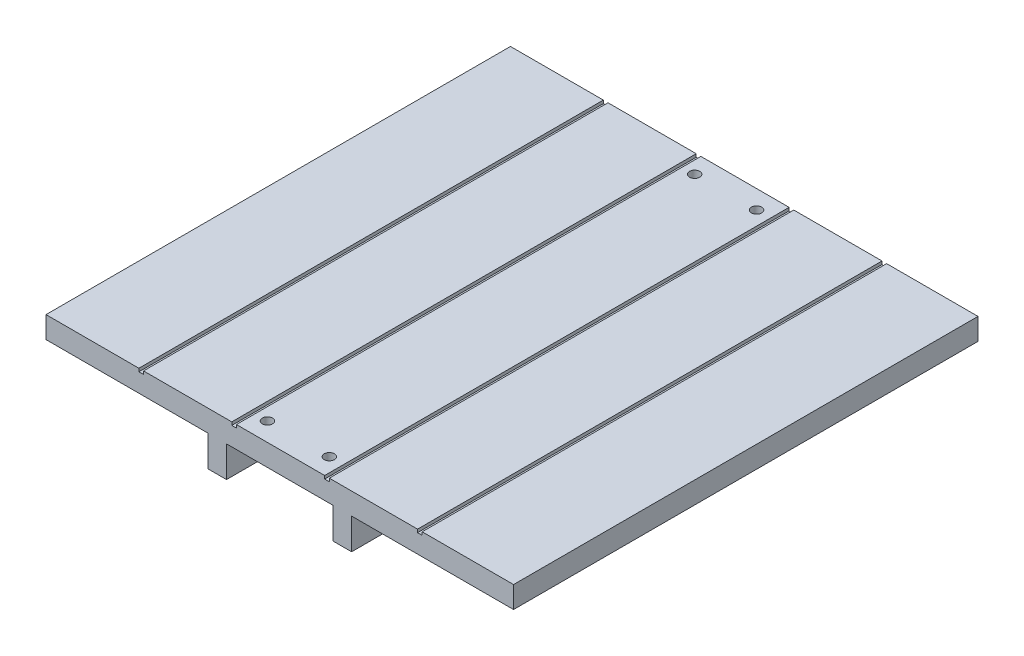
ISO-10303-21;
HEADER;
FILE_DESCRIPTION(('STEP AP214'),'2;1');
FILE_NAME('part.step','',(''),(''),'','','');
FILE_SCHEMA(('AUTOMOTIVE_DESIGN { 1 0 10303 214 1 1 1 1 }'));
ENDSEC;
DATA;
#1=APPLICATION_CONTEXT('core data for automotive mechanical design processes');
#2=APPLICATION_PROTOCOL_DEFINITION('international standard','automotive_design',2000,#1);
#3=PRODUCT_CONTEXT('',#1,'mechanical');
#4=PRODUCT('Part','Part','',(#3));
#5=PRODUCT_RELATED_PRODUCT_CATEGORY('part','',(#4));
#6=PRODUCT_DEFINITION_FORMATION('','',#4);
#7=PRODUCT_DEFINITION_CONTEXT('part definition',#1,'design');
#8=PRODUCT_DEFINITION('design','',#6,#7);
#9=PRODUCT_DEFINITION_SHAPE('','',#8);
#10=(LENGTH_UNIT() NAMED_UNIT(*) SI_UNIT(.MILLI.,.METRE.));
#11=(NAMED_UNIT(*) PLANE_ANGLE_UNIT() SI_UNIT($,.RADIAN.));
#12=(NAMED_UNIT(*) SI_UNIT($,.STERADIAN.) SOLID_ANGLE_UNIT());
#13=UNCERTAINTY_MEASURE_WITH_UNIT(LENGTH_MEASURE(1.E-05),#10,'distance_accuracy_value','');
#14=(GEOMETRIC_REPRESENTATION_CONTEXT(3) GLOBAL_UNCERTAINTY_ASSIGNED_CONTEXT((#13)) GLOBAL_UNIT_ASSIGNED_CONTEXT((#10,
#11,#12)) REPRESENTATION_CONTEXT('',''));
#15=CARTESIAN_POINT('',(0.,0.,0.));
#16=DIRECTION('',(0.,0.,1.));
#17=DIRECTION('',(1.,0.,0.));
#18=AXIS2_PLACEMENT_3D('',#15,#16,#17);
#19=CARTESIAN_POINT('',(-75.5,3.5,150.));
#20=DIRECTION('',(0.,-1.,0.));
#21=DIRECTION('',(0.,0.,-1.));
#22=AXIS2_PLACEMENT_3D('',#19,#20,#21);
#23=PLANE('',#22);
#24=DIRECTION('',(-1.,0.,0.));
#25=VECTOR('',#24,1.);
#26=CARTESIAN_POINT('',(-75.5,3.5,150.));
#27=LINE('',#26,#25);
#28=CARTESIAN_POINT('',(-45.5,3.5,150.));
#29=VERTEX_POINT('',#28);
#30=CARTESIAN_POINT('',(-75.5,3.5,150.));
#31=VERTEX_POINT('',#30);
#32=EDGE_CURVE('E356',#29,#31,#27,.T.);
#33=ORIENTED_EDGE('',*,*,#32,.F.);
#34=DIRECTION('',(0.,0.,1.));
#35=VECTOR('',#34,1.);
#36=CARTESIAN_POINT('',(-45.5,3.5,0.));
#37=LINE('',#36,#35);
#38=CARTESIAN_POINT('',(-45.5,3.5,0.));
#39=VERTEX_POINT('',#38);
#40=EDGE_CURVE('E227',#39,#29,#37,.T.);
#41=ORIENTED_EDGE('',*,*,#40,.F.);
#42=DIRECTION('',(-1.,0.,0.));
#43=VECTOR('',#42,1.);
#44=CARTESIAN_POINT('',(-75.5,3.5,0.));
#45=LINE('',#44,#43);
#46=CARTESIAN_POINT('',(-75.5,3.5,0.));
#47=VERTEX_POINT('',#46);
#48=EDGE_CURVE('E384',#39,#47,#45,.T.);
#49=ORIENTED_EDGE('',*,*,#48,.T.);
#50=DIRECTION('',(0.,0.,-1.));
#51=VECTOR('',#50,1.);
#52=CARTESIAN_POINT('',(-75.5,3.5,150.));
#53=LINE('',#52,#51);
#54=EDGE_CURVE('E432',#31,#47,#53,.T.);
#55=ORIENTED_EDGE('',*,*,#54,.F.);
#56=EDGE_LOOP('',(#33,#41,#49,#55));
#57=FACE_BOUND('',#56,.T.);
#58=ADVANCED_FACE('F36',(#57),#23,.F.);
#59=CARTESIAN_POINT('',(-9.99999999999998,3.5,6.));
#60=DIRECTION('',(0.,-1.,0.));
#61=DIRECTION('',(0.,0.,-1.));
#62=AXIS2_PLACEMENT_3D('',#59,#60,#61);
#63=CIRCLE('',#62,1.65);
#64=CARTESIAN_POINT('',(-9.99999999999998,3.5,4.35));
#65=VERTEX_POINT('',#64);
#66=EDGE_CURVE('E346',#65,#65,#63,.F.);
#67=ORIENTED_EDGE('',*,*,#66,.F.);
#68=EDGE_LOOP('',(#67));
#69=FACE_BOUND('',#68,.T.);
#70=CARTESIAN_POINT('',(10.,3.5,144.));
#71=DIRECTION('',(0.,-1.,0.));
#72=DIRECTION('',(0.,0.,-1.));
#73=AXIS2_PLACEMENT_3D('',#70,#71,#72);
#74=CIRCLE('',#73,1.65);
#75=CARTESIAN_POINT('',(10.,3.5,142.35));
#76=VERTEX_POINT('',#75);
#77=EDGE_CURVE('E328',#76,#76,#74,.F.);
#78=ORIENTED_EDGE('',*,*,#77,.F.);
#79=EDGE_LOOP('',(#78));
#80=FACE_BOUND('',#79,.T.);
#81=CARTESIAN_POINT('',(-10.,3.5,144.));
#82=DIRECTION('',(0.,-1.,0.));
#83=DIRECTION('',(0.,0.,-1.));
#84=AXIS2_PLACEMENT_3D('',#81,#82,#83);
#85=CIRCLE('',#84,1.65);
#86=CARTESIAN_POINT('',(-10.,3.5,142.35));
#87=VERTEX_POINT('',#86);
#88=EDGE_CURVE('E336',#87,#87,#85,.F.);
#89=ORIENTED_EDGE('',*,*,#88,.F.);
#90=EDGE_LOOP('',(#89));
#91=FACE_BOUND('',#90,.T.);
#92=CARTESIAN_POINT('',(9.99999999999998,3.5,6.));
#93=DIRECTION('',(0.,-1.,0.));
#94=DIRECTION('',(0.,0.,-1.));
#95=AXIS2_PLACEMENT_3D('',#92,#93,#94);
#96=CIRCLE('',#95,1.65);
#97=CARTESIAN_POINT('',(9.99999999999998,3.5,4.35));
#98=VERTEX_POINT('',#97);
#99=EDGE_CURVE('E335',#98,#98,#96,.F.);
#100=ORIENTED_EDGE('',*,*,#99,.F.);
#101=EDGE_LOOP('',(#100));
#102=FACE_BOUND('',#101,.T.);
#103=CARTESIAN_POINT('',(14.5,3.5,0.));
#104=VERTEX_POINT('',#103);
#105=CARTESIAN_POINT('',(-14.,3.5,0.));
#106=VERTEX_POINT('',#105);
#107=EDGE_CURVE('E507',#104,#106,#45,.T.);
#108=ORIENTED_EDGE('',*,*,#107,.T.);
#109=DIRECTION('',(0.,0.,-1.));
#110=VECTOR('',#109,1.);
#111=CARTESIAN_POINT('',(-14.,3.5,0.));
#112=LINE('',#111,#110);
#113=CARTESIAN_POINT('',(-14.,3.5,150.));
#114=VERTEX_POINT('',#113);
#115=EDGE_CURVE('E260',#114,#106,#112,.T.);
#116=ORIENTED_EDGE('',*,*,#115,.F.);
#117=CARTESIAN_POINT('',(14.5,3.5,150.));
#118=VERTEX_POINT('',#117);
#119=EDGE_CURVE('E533',#118,#114,#27,.T.);
#120=ORIENTED_EDGE('',*,*,#119,.F.);
#121=DIRECTION('',(0.,0.,1.));
#122=VECTOR('',#121,1.);
#123=CARTESIAN_POINT('',(14.5,3.5,0.));
#124=LINE('',#123,#122);
#125=EDGE_CURVE('E291',#104,#118,#124,.T.);
#126=ORIENTED_EDGE('',*,*,#125,.F.);
#127=EDGE_LOOP('',(#108,#116,#120,#126));
#128=FACE_BOUND('',#127,.T.);
#129=ADVANCED_FACE('F540',(#69,#80,#91,#102,#128),#23,.F.);
#130=CARTESIAN_POINT('',(44.5,3.5,0.));
#131=VERTEX_POINT('',#130);
#132=CARTESIAN_POINT('',(16.,3.5,0.));
#133=VERTEX_POINT('',#132);
#134=EDGE_CURVE('E389',#131,#133,#45,.T.);
#135=ORIENTED_EDGE('',*,*,#134,.T.);
#136=DIRECTION('',(0.,0.,-1.));
#137=VECTOR('',#136,1.);
#138=CARTESIAN_POINT('',(16.,3.5,0.));
#139=LINE('',#138,#137);
#140=CARTESIAN_POINT('',(16.,3.5,150.));
#141=VERTEX_POINT('',#140);
#142=EDGE_CURVE('E283',#141,#133,#139,.T.);
#143=ORIENTED_EDGE('',*,*,#142,.F.);
#144=CARTESIAN_POINT('',(44.5,3.5,150.));
#145=VERTEX_POINT('',#144);
#146=EDGE_CURVE('E361',#145,#141,#27,.T.);
#147=ORIENTED_EDGE('',*,*,#146,.F.);
#148=DIRECTION('',(0.,0.,1.));
#149=VECTOR('',#148,1.);
#150=CARTESIAN_POINT('',(44.5,3.5,0.));
#151=LINE('',#150,#149);
#152=EDGE_CURVE('E315',#131,#145,#151,.T.);
#153=ORIENTED_EDGE('',*,*,#152,.F.);
#154=EDGE_LOOP('',(#135,#143,#147,#153));
#155=FACE_BOUND('',#154,.T.);
#156=ADVANCED_FACE('F522',(#155),#23,.F.);
#157=CARTESIAN_POINT('',(75.5,3.5,0.));
#158=VERTEX_POINT('',#157);
#159=CARTESIAN_POINT('',(46.,3.5,0.));
#160=VERTEX_POINT('',#159);
#161=EDGE_CURVE('E385',#158,#160,#45,.T.);
#162=ORIENTED_EDGE('',*,*,#161,.T.);
#163=DIRECTION('',(0.,0.,-1.));
#164=VECTOR('',#163,1.);
#165=CARTESIAN_POINT('',(46.,3.5,0.));
#166=LINE('',#165,#164);
#167=CARTESIAN_POINT('',(46.,3.5,150.));
#168=VERTEX_POINT('',#167);
#169=EDGE_CURVE('E307',#168,#160,#166,.T.);
#170=ORIENTED_EDGE('',*,*,#169,.F.);
#171=CARTESIAN_POINT('',(75.5,3.5,150.));
#172=VERTEX_POINT('',#171);
#173=EDGE_CURVE('E357',#172,#168,#27,.T.);
#174=ORIENTED_EDGE('',*,*,#173,.F.);
#175=DIRECTION('',(0.,0.,-1.));
#176=VECTOR('',#175,1.);
#177=CARTESIAN_POINT('',(75.5,3.5,150.));
#178=LINE('',#177,#176);
#179=EDGE_CURVE('E44',#172,#158,#178,.T.);
#180=ORIENTED_EDGE('',*,*,#179,.T.);
#181=EDGE_LOOP('',(#162,#170,#174,#180));
#182=FACE_BOUND('',#181,.T.);
#183=ADVANCED_FACE('F439',(#182),#23,.F.);
#184=CARTESIAN_POINT('',(23.2,-3.49999999999996,150.));
#185=DIRECTION('',(0.,1.,0.));
#186=DIRECTION('',(-1.,0.,0.));
#187=AXIS2_PLACEMENT_3D('',#184,#185,#186);
#188=PLANE('',#187);
#189=DIRECTION('',(1.,0.,0.));
#190=VECTOR('',#189,1.);
#191=CARTESIAN_POINT('',(23.2,-3.49999999999996,0.));
#192=LINE('',#191,#190);
#193=CARTESIAN_POINT('',(23.2,-3.49999999999996,0.));
#194=VERTEX_POINT('',#193);
#195=CARTESIAN_POINT('',(75.5,-3.5,0.));
#196=VERTEX_POINT('',#195);
#197=EDGE_CURVE('E349',#194,#196,#192,.T.);
#198=ORIENTED_EDGE('',*,*,#197,.T.);
#199=DIRECTION('',(0.,0.,-1.));
#200=VECTOR('',#199,1.);
#201=CARTESIAN_POINT('',(75.5,-3.5,150.));
#202=LINE('',#201,#200);
#203=CARTESIAN_POINT('',(75.5,-3.5,150.));
#204=VERTEX_POINT('',#203);
#205=EDGE_CURVE('E11',#204,#196,#202,.T.);
#206=ORIENTED_EDGE('',*,*,#205,.F.);
#207=DIRECTION('',(1.,0.,0.));
#208=VECTOR('',#207,1.);
#209=CARTESIAN_POINT('',(23.2,-3.49999999999996,150.));
#210=LINE('',#209,#208);
#211=CARTESIAN_POINT('',(23.2,-3.49999999999996,150.));
#212=VERTEX_POINT('',#211);
#213=EDGE_CURVE('E350',#212,#204,#210,.T.);
#214=ORIENTED_EDGE('',*,*,#213,.F.);
#215=DIRECTION('',(0.,0.,-1.));
#216=VECTOR('',#215,1.);
#217=CARTESIAN_POINT('',(23.2,-3.49999999999996,150.));
#218=LINE('',#217,#216);
#219=EDGE_CURVE('E379',#212,#194,#218,.T.);
#220=ORIENTED_EDGE('',*,*,#219,.T.);
#221=EDGE_LOOP('',(#198,#206,#214,#220));
#222=FACE_BOUND('',#221,.T.);
#223=ADVANCED_FACE('F38',(#222),#188,.F.);
#224=CARTESIAN_POINT('',(75.5,3.5,150.));
#225=DIRECTION('',(-1.,0.,0.));
#226=DIRECTION('',(0.,0.,1.));
#227=AXIS2_PLACEMENT_3D('',#224,#225,#226);
#228=PLANE('',#227);
#229=DIRECTION('',(0.,1.,0.));
#230=VECTOR('',#229,1.);
#231=CARTESIAN_POINT('',(75.5,3.5,0.));
#232=LINE('',#231,#230);
#233=EDGE_CURVE('E382',#196,#158,#232,.T.);
#234=ORIENTED_EDGE('',*,*,#233,.T.);
#235=ORIENTED_EDGE('',*,*,#179,.F.);
#236=DIRECTION('',(0.,1.,0.));
#237=VECTOR('',#236,1.);
#238=CARTESIAN_POINT('',(75.5,3.5,150.));
#239=LINE('',#238,#237);
#240=EDGE_CURVE('E353',#204,#172,#239,.T.);
#241=ORIENTED_EDGE('',*,*,#240,.F.);
#242=ORIENTED_EDGE('',*,*,#205,.T.);
#243=EDGE_LOOP('',(#234,#235,#241,#242));
#244=FACE_BOUND('',#243,.T.);
#245=ADVANCED_FACE('F455',(#244),#228,.F.);
#246=CARTESIAN_POINT('',(-15.5,3.5,0.));
#247=VERTEX_POINT('',#246);
#248=CARTESIAN_POINT('',(-44.,3.5,0.));
#249=VERTEX_POINT('',#248);
#250=EDGE_CURVE('E505',#247,#249,#45,.T.);
#251=ORIENTED_EDGE('',*,*,#250,.T.);
#252=DIRECTION('',(0.,0.,-1.));
#253=VECTOR('',#252,1.);
#254=CARTESIAN_POINT('',(-44.,3.5,0.));
#255=LINE('',#254,#253);
#256=CARTESIAN_POINT('',(-44.,3.5,150.));
#257=VERTEX_POINT('',#256);
#258=EDGE_CURVE('E239',#257,#249,#255,.T.);
#259=ORIENTED_EDGE('',*,*,#258,.F.);
#260=CARTESIAN_POINT('',(-15.5,3.5,150.));
#261=VERTEX_POINT('',#260);
#262=EDGE_CURVE('E535',#261,#257,#27,.T.);
#263=ORIENTED_EDGE('',*,*,#262,.F.);
#264=DIRECTION('',(0.,0.,1.));
#265=VECTOR('',#264,1.);
#266=CARTESIAN_POINT('',(-15.5,3.5,0.));
#267=LINE('',#266,#265);
#268=EDGE_CURVE('E267',#247,#261,#267,.T.);
#269=ORIENTED_EDGE('',*,*,#268,.F.);
#270=EDGE_LOOP('',(#251,#259,#263,#269));
#271=FACE_BOUND('',#270,.T.);
#272=ADVANCED_FACE('F542',(#271),#23,.F.);
#273=CARTESIAN_POINT('',(-75.5,3.5,150.));
#274=DIRECTION('',(1.,0.,0.));
#275=DIRECTION('',(0.,0.,-1.));
#276=AXIS2_PLACEMENT_3D('',#273,#274,#275);
#277=PLANE('',#276);
#278=DIRECTION('',(0.,-1.,0.));
#279=VECTOR('',#278,1.);
#280=CARTESIAN_POINT('',(-75.5,3.5,0.));
#281=LINE('',#280,#279);
#282=CARTESIAN_POINT('',(-75.5,-3.5,0.));
#283=VERTEX_POINT('',#282);
#284=EDGE_CURVE('E388',#47,#283,#281,.T.);
#285=ORIENTED_EDGE('',*,*,#284,.T.);
#286=DIRECTION('',(0.,0.,-1.));
#287=VECTOR('',#286,1.);
#288=CARTESIAN_POINT('',(-75.5,-3.5,150.));
#289=LINE('',#288,#287);
#290=CARTESIAN_POINT('',(-75.5,-3.5,150.));
#291=VERTEX_POINT('',#290);
#292=EDGE_CURVE('E429',#291,#283,#289,.T.);
#293=ORIENTED_EDGE('',*,*,#292,.F.);
#294=DIRECTION('',(0.,-1.,0.));
#295=VECTOR('',#294,1.);
#296=CARTESIAN_POINT('',(-75.5,3.5,150.));
#297=LINE('',#296,#295);
#298=EDGE_CURVE('E360',#31,#291,#297,.T.);
#299=ORIENTED_EDGE('',*,*,#298,.F.);
#300=ORIENTED_EDGE('',*,*,#54,.T.);
#301=EDGE_LOOP('',(#285,#293,#299,#300));
#302=FACE_BOUND('',#301,.T.);
#303=ADVANCED_FACE('F501',(#302),#277,.F.);
#304=CARTESIAN_POINT('',(-75.5,-3.5,150.));
#305=DIRECTION('',(0.,1.,0.));
#306=DIRECTION('',(-1.,0.,0.));
#307=AXIS2_PLACEMENT_3D('',#304,#305,#306);
#308=PLANE('',#307);
#309=DIRECTION('',(1.,0.,0.));
#310=VECTOR('',#309,1.);
#311=CARTESIAN_POINT('',(-75.5,-3.5,0.));
#312=LINE('',#311,#310);
#313=CARTESIAN_POINT('',(-23.2,-3.49999999999996,0.));
#314=VERTEX_POINT('',#313);
#315=EDGE_CURVE('E391',#283,#314,#312,.T.);
#316=ORIENTED_EDGE('',*,*,#315,.T.);
#317=DIRECTION('',(0.,0.,-1.));
#318=VECTOR('',#317,1.);
#319=CARTESIAN_POINT('',(-23.2,-3.49999999999996,150.));
#320=LINE('',#319,#318);
#321=CARTESIAN_POINT('',(-23.2,-3.49999999999996,150.));
#322=VERTEX_POINT('',#321);
#323=EDGE_CURVE('E426',#322,#314,#320,.T.);
#324=ORIENTED_EDGE('',*,*,#323,.F.);
#325=DIRECTION('',(1.,0.,0.));
#326=VECTOR('',#325,1.);
#327=CARTESIAN_POINT('',(-75.5,-3.5,150.));
#328=LINE('',#327,#326);
#329=EDGE_CURVE('E363',#291,#322,#328,.T.);
#330=ORIENTED_EDGE('',*,*,#329,.F.);
#331=ORIENTED_EDGE('',*,*,#292,.T.);
#332=EDGE_LOOP('',(#316,#324,#330,#331));
#333=FACE_BOUND('',#332,.T.);
#334=ADVANCED_FACE('F497',(#333),#308,.F.);
#335=CARTESIAN_POINT('',(-23.2,-13.5,150.));
#336=DIRECTION('',(1.,0.,0.));
#337=DIRECTION('',(0.,1.,0.));
#338=AXIS2_PLACEMENT_3D('',#335,#336,#337);
#339=PLANE('',#338);
#340=DIRECTION('',(0.,-1.,0.));
#341=VECTOR('',#340,1.);
#342=CARTESIAN_POINT('',(-23.2,-13.5,0.));
#343=LINE('',#342,#341);
#344=CARTESIAN_POINT('',(-23.2,-13.5,0.));
#345=VERTEX_POINT('',#344);
#346=EDGE_CURVE('E393',#314,#345,#343,.T.);
#347=ORIENTED_EDGE('',*,*,#346,.T.);
#348=DIRECTION('',(0.,0.,-1.));
#349=VECTOR('',#348,1.);
#350=CARTESIAN_POINT('',(-23.2,-13.5,150.));
#351=LINE('',#350,#349);
#352=CARTESIAN_POINT('',(-23.2,-13.5,150.));
#353=VERTEX_POINT('',#352);
#354=EDGE_CURVE('E423',#353,#345,#351,.T.);
#355=ORIENTED_EDGE('',*,*,#354,.F.);
#356=DIRECTION('',(0.,-1.,0.));
#357=VECTOR('',#356,1.);
#358=CARTESIAN_POINT('',(-23.2,-13.5,150.));
#359=LINE('',#358,#357);
#360=EDGE_CURVE('E365',#322,#353,#359,.T.);
#361=ORIENTED_EDGE('',*,*,#360,.F.);
#362=ORIENTED_EDGE('',*,*,#323,.T.);
#363=EDGE_LOOP('',(#347,#355,#361,#362));
#364=FACE_BOUND('',#363,.T.);
#365=ADVANCED_FACE('F492',(#364),#339,.F.);
#366=CARTESIAN_POINT('',(-17.2,-13.5,150.));
#367=DIRECTION('',(0.,1.,0.));
#368=DIRECTION('',(-1.,0.,0.));
#369=AXIS2_PLACEMENT_3D('',#366,#367,#368);
#370=PLANE('',#369);
#371=DIRECTION('',(1.,0.,0.));
#372=VECTOR('',#371,1.);
#373=CARTESIAN_POINT('',(-17.2,-13.5,0.));
#374=LINE('',#373,#372);
#375=CARTESIAN_POINT('',(-17.2,-13.5,0.));
#376=VERTEX_POINT('',#375);
#377=EDGE_CURVE('E395',#345,#376,#374,.T.);
#378=ORIENTED_EDGE('',*,*,#377,.T.);
#379=DIRECTION('',(0.,0.,-1.));
#380=VECTOR('',#379,1.);
#381=CARTESIAN_POINT('',(-17.2,-13.5,150.));
#382=LINE('',#381,#380);
#383=CARTESIAN_POINT('',(-17.2,-13.5,150.));
#384=VERTEX_POINT('',#383);
#385=EDGE_CURVE('E420',#384,#376,#382,.T.);
#386=ORIENTED_EDGE('',*,*,#385,.F.);
#387=DIRECTION('',(1.,0.,0.));
#388=VECTOR('',#387,1.);
#389=CARTESIAN_POINT('',(-17.2,-13.5,150.));
#390=LINE('',#389,#388);
#391=EDGE_CURVE('E367',#353,#384,#390,.T.);
#392=ORIENTED_EDGE('',*,*,#391,.F.);
#393=ORIENTED_EDGE('',*,*,#354,.T.);
#394=EDGE_LOOP('',(#378,#386,#392,#393));
#395=FACE_BOUND('',#394,.T.);
#396=ADVANCED_FACE('F486',(#395),#370,.F.);
#397=CARTESIAN_POINT('',(-17.2,-3.49999999999996,150.));
#398=DIRECTION('',(-1.,0.,0.));
#399=DIRECTION('',(0.,-1.,0.));
#400=AXIS2_PLACEMENT_3D('',#397,#398,#399);
#401=PLANE('',#400);
#402=DIRECTION('',(0.,1.,0.));
#403=VECTOR('',#402,1.);
#404=CARTESIAN_POINT('',(-17.2,-3.49999999999996,0.));
#405=LINE('',#404,#403);
#406=CARTESIAN_POINT('',(-17.2,-3.49999999999996,0.));
#407=VERTEX_POINT('',#406);
#408=EDGE_CURVE('E397',#376,#407,#405,.T.);
#409=ORIENTED_EDGE('',*,*,#408,.T.);
#410=DIRECTION('',(0.,0.,-1.));
#411=VECTOR('',#410,1.);
#412=CARTESIAN_POINT('',(-17.2,-3.49999999999996,150.));
#413=LINE('',#412,#411);
#414=CARTESIAN_POINT('',(-17.2,-3.49999999999996,150.));
#415=VERTEX_POINT('',#414);
#416=EDGE_CURVE('E417',#415,#407,#413,.T.);
#417=ORIENTED_EDGE('',*,*,#416,.F.);
#418=DIRECTION('',(0.,1.,0.));
#419=VECTOR('',#418,1.);
#420=CARTESIAN_POINT('',(-17.2,-3.49999999999996,150.));
#421=LINE('',#420,#419);
#422=EDGE_CURVE('E369',#384,#415,#421,.T.);
#423=ORIENTED_EDGE('',*,*,#422,.F.);
#424=ORIENTED_EDGE('',*,*,#385,.T.);
#425=EDGE_LOOP('',(#409,#417,#423,#424));
#426=FACE_BOUND('',#425,.T.);
#427=ADVANCED_FACE('F482',(#426),#401,.F.);
#428=CARTESIAN_POINT('',(-17.2,-3.49999999999996,150.));
#429=DIRECTION('',(0.,1.,0.));
#430=DIRECTION('',(0.,0.,1.));
#431=AXIS2_PLACEMENT_3D('',#428,#429,#430);
#432=PLANE('',#431);
#433=CARTESIAN_POINT('',(9.99999999999998,-3.49999999999996,6.));
#434=DIRECTION('',(0.,-1.,0.));
#435=DIRECTION('',(0.,0.,1.));
#436=AXIS2_PLACEMENT_3D('',#433,#434,#435);
#437=CIRCLE('',#436,1.65);
#438=CARTESIAN_POINT('',(9.99999999999998,-3.49999999999996,7.65));
#439=VERTEX_POINT('',#438);
#440=EDGE_CURVE('E332',#439,#439,#437,.T.);
#441=ORIENTED_EDGE('',*,*,#440,.F.);
#442=EDGE_LOOP('',(#441));
#443=FACE_BOUND('',#442,.T.);
#444=CARTESIAN_POINT('',(-10.,-3.49999999999996,144.));
#445=DIRECTION('',(0.,-1.,0.));
#446=DIRECTION('',(0.,0.,-1.));
#447=AXIS2_PLACEMENT_3D('',#444,#445,#446);
#448=CIRCLE('',#447,1.65);
#449=CARTESIAN_POINT('',(-10.,-3.49999999999996,142.35));
#450=VERTEX_POINT('',#449);
#451=EDGE_CURVE('E331',#450,#450,#448,.T.);
#452=ORIENTED_EDGE('',*,*,#451,.F.);
#453=EDGE_LOOP('',(#452));
#454=FACE_BOUND('',#453,.T.);
#455=CARTESIAN_POINT('',(10.,-3.49999999999996,144.));
#456=DIRECTION('',(0.,-1.,0.));
#457=DIRECTION('',(0.,0.,1.));
#458=AXIS2_PLACEMENT_3D('',#455,#456,#457);
#459=CIRCLE('',#458,1.65);
#460=CARTESIAN_POINT('',(10.,-3.49999999999996,145.65));
#461=VERTEX_POINT('',#460);
#462=EDGE_CURVE('E252',#461,#461,#459,.T.);
#463=ORIENTED_EDGE('',*,*,#462,.F.);
#464=EDGE_LOOP('',(#463));
#465=FACE_BOUND('',#464,.T.);
#466=CARTESIAN_POINT('',(-9.99999999999998,-3.49999999999996,6.));
#467=DIRECTION('',(0.,-1.,0.));
#468=DIRECTION('',(0.,0.,-1.));
#469=AXIS2_PLACEMENT_3D('',#466,#467,#468);
#470=CIRCLE('',#469,1.65);
#471=CARTESIAN_POINT('',(-9.99999999999998,-3.49999999999996,4.35));
#472=VERTEX_POINT('',#471);
#473=EDGE_CURVE('E339',#472,#472,#470,.T.);
#474=ORIENTED_EDGE('',*,*,#473,.F.);
#475=EDGE_LOOP('',(#474));
#476=FACE_BOUND('',#475,.T.);
#477=DIRECTION('',(1.,0.,0.));
#478=VECTOR('',#477,1.);
#479=CARTESIAN_POINT('',(-17.2,-3.49999999999996,0.));
#480=LINE('',#479,#478);
#481=CARTESIAN_POINT('',(17.2,-3.49999999999996,0.));
#482=VERTEX_POINT('',#481);
#483=EDGE_CURVE('E399',#407,#482,#480,.T.);
#484=ORIENTED_EDGE('',*,*,#483,.T.);
#485=DIRECTION('',(0.,0.,-1.));
#486=VECTOR('',#485,1.);
#487=CARTESIAN_POINT('',(17.2,-3.49999999999996,150.));
#488=LINE('',#487,#486);
#489=CARTESIAN_POINT('',(17.2,-3.49999999999996,150.));
#490=VERTEX_POINT('',#489);
#491=EDGE_CURVE('E414',#490,#482,#488,.T.);
#492=ORIENTED_EDGE('',*,*,#491,.F.);
#493=DIRECTION('',(1.,0.,0.));
#494=VECTOR('',#493,1.);
#495=CARTESIAN_POINT('',(-17.2,-3.49999999999996,150.));
#496=LINE('',#495,#494);
#497=EDGE_CURVE('E371',#415,#490,#496,.T.);
#498=ORIENTED_EDGE('',*,*,#497,.F.);
#499=ORIENTED_EDGE('',*,*,#416,.T.);
#500=EDGE_LOOP('',(#484,#492,#498,#499));
#501=FACE_BOUND('',#500,.T.);
#502=ADVANCED_FACE('F477',(#443,#454,#465,#476,#501),#432,.F.);
#503=CARTESIAN_POINT('',(17.2,-3.49999999999996,150.));
#504=DIRECTION('',(1.,0.,0.));
#505=DIRECTION('',(0.,0.,-1.));
#506=AXIS2_PLACEMENT_3D('',#503,#504,#505);
#507=PLANE('',#506);
#508=DIRECTION('',(0.,-1.,0.));
#509=VECTOR('',#508,1.);
#510=CARTESIAN_POINT('',(17.2,-3.49999999999996,0.));
#511=LINE('',#510,#509);
#512=CARTESIAN_POINT('',(17.2,-13.5,0.));
#513=VERTEX_POINT('',#512);
#514=EDGE_CURVE('E401',#482,#513,#511,.T.);
#515=ORIENTED_EDGE('',*,*,#514,.T.);
#516=DIRECTION('',(0.,0.,-1.));
#517=VECTOR('',#516,1.);
#518=CARTESIAN_POINT('',(17.2,-13.5,150.));
#519=LINE('',#518,#517);
#520=CARTESIAN_POINT('',(17.2,-13.5,150.));
#521=VERTEX_POINT('',#520);
#522=EDGE_CURVE('E411',#521,#513,#519,.T.);
#523=ORIENTED_EDGE('',*,*,#522,.F.);
#524=DIRECTION('',(0.,-1.,0.));
#525=VECTOR('',#524,1.);
#526=CARTESIAN_POINT('',(17.2,-3.49999999999996,150.));
#527=LINE('',#526,#525);
#528=EDGE_CURVE('E373',#490,#521,#527,.T.);
#529=ORIENTED_EDGE('',*,*,#528,.F.);
#530=ORIENTED_EDGE('',*,*,#491,.T.);
#531=EDGE_LOOP('',(#515,#523,#529,#530));
#532=FACE_BOUND('',#531,.T.);
#533=ADVANCED_FACE('F471',(#532),#507,.F.);
#534=CARTESIAN_POINT('',(17.2,-13.5,150.));
#535=DIRECTION('',(0.,1.,0.));
#536=DIRECTION('',(0.,0.,1.));
#537=AXIS2_PLACEMENT_3D('',#534,#535,#536);
#538=PLANE('',#537);
#539=DIRECTION('',(1.,0.,0.));
#540=VECTOR('',#539,1.);
#541=CARTESIAN_POINT('',(17.2,-13.5,0.));
#542=LINE('',#541,#540);
#543=CARTESIAN_POINT('',(23.2,-13.5,0.));
#544=VERTEX_POINT('',#543);
#545=EDGE_CURVE('E403',#513,#544,#542,.T.);
#546=ORIENTED_EDGE('',*,*,#545,.T.);
#547=DIRECTION('',(0.,0.,-1.));
#548=VECTOR('',#547,1.);
#549=CARTESIAN_POINT('',(23.2,-13.5,150.));
#550=LINE('',#549,#548);
#551=CARTESIAN_POINT('',(23.2,-13.5,150.));
#552=VERTEX_POINT('',#551);
#553=EDGE_CURVE('E408',#552,#544,#550,.T.);
#554=ORIENTED_EDGE('',*,*,#553,.F.);
#555=DIRECTION('',(1.,0.,0.));
#556=VECTOR('',#555,1.);
#557=CARTESIAN_POINT('',(17.2,-13.5,150.));
#558=LINE('',#557,#556);
#559=EDGE_CURVE('E375',#521,#552,#558,.T.);
#560=ORIENTED_EDGE('',*,*,#559,.F.);
#561=ORIENTED_EDGE('',*,*,#522,.T.);
#562=EDGE_LOOP('',(#546,#554,#560,#561));
#563=FACE_BOUND('',#562,.T.);
#564=ADVANCED_FACE('F467',(#563),#538,.F.);
#565=CARTESIAN_POINT('',(23.2,-13.5,150.));
#566=DIRECTION('',(-1.,0.,0.));
#567=DIRECTION('',(0.,0.,1.));
#568=AXIS2_PLACEMENT_3D('',#565,#566,#567);
#569=PLANE('',#568);
#570=DIRECTION('',(0.,1.,0.));
#571=VECTOR('',#570,1.);
#572=CARTESIAN_POINT('',(23.2,-13.5,0.));
#573=LINE('',#572,#571);
#574=EDGE_CURVE('E354',#544,#194,#573,.T.);
#575=ORIENTED_EDGE('',*,*,#574,.T.);
#576=ORIENTED_EDGE('',*,*,#219,.F.);
#577=DIRECTION('',(0.,1.,0.));
#578=VECTOR('',#577,1.);
#579=CARTESIAN_POINT('',(23.2,-13.5,150.));
#580=LINE('',#579,#578);
#581=EDGE_CURVE('E377',#552,#212,#580,.T.);
#582=ORIENTED_EDGE('',*,*,#581,.F.);
#583=ORIENTED_EDGE('',*,*,#553,.T.);
#584=EDGE_LOOP('',(#575,#576,#582,#583));
#585=FACE_BOUND('',#584,.T.);
#586=ADVANCED_FACE('F462',(#585),#569,.F.);
#587=CARTESIAN_POINT('',(0.,0.,150.));
#588=DIRECTION('',(0.,0.,-1.));
#589=DIRECTION('',(-1.,0.,0.));
#590=AXIS2_PLACEMENT_3D('',#587,#588,#589);
#591=PLANE('',#590);
#592=DIRECTION('',(1.,0.,0.));
#593=VECTOR('',#592,1.);
#594=CARTESIAN_POINT('',(-45.5,2.5,150.));
#595=LINE('',#594,#593);
#596=CARTESIAN_POINT('',(-45.5,2.5,150.));
#597=VERTEX_POINT('',#596);
#598=CARTESIAN_POINT('',(-44.,2.5,150.));
#599=VERTEX_POINT('',#598);
#600=EDGE_CURVE('E235',#597,#599,#595,.T.);
#601=ORIENTED_EDGE('',*,*,#600,.F.);
#602=DIRECTION('',(0.,1.,0.));
#603=VECTOR('',#602,1.);
#604=CARTESIAN_POINT('',(-45.5,2.5,150.));
#605=LINE('',#604,#603);
#606=EDGE_CURVE('E222',#597,#29,#605,.T.);
#607=ORIENTED_EDGE('',*,*,#606,.T.);
#608=ORIENTED_EDGE('',*,*,#32,.T.);
#609=ORIENTED_EDGE('',*,*,#298,.T.);
#610=ORIENTED_EDGE('',*,*,#329,.T.);
#611=ORIENTED_EDGE('',*,*,#360,.T.);
#612=ORIENTED_EDGE('',*,*,#391,.T.);
#613=ORIENTED_EDGE('',*,*,#422,.T.);
#614=ORIENTED_EDGE('',*,*,#497,.T.);
#615=ORIENTED_EDGE('',*,*,#528,.T.);
#616=ORIENTED_EDGE('',*,*,#559,.T.);
#617=ORIENTED_EDGE('',*,*,#581,.T.);
#618=ORIENTED_EDGE('',*,*,#213,.T.);
#619=ORIENTED_EDGE('',*,*,#240,.T.);
#620=ORIENTED_EDGE('',*,*,#173,.T.);
#621=DIRECTION('',(0.,1.,0.));
#622=VECTOR('',#621,1.);
#623=CARTESIAN_POINT('',(46.,2.5,150.));
#624=LINE('',#623,#622);
#625=CARTESIAN_POINT('',(46.,2.5,150.));
#626=VERTEX_POINT('',#625);
#627=EDGE_CURVE('E320',#626,#168,#624,.T.);
#628=ORIENTED_EDGE('',*,*,#627,.F.);
#629=DIRECTION('',(1.,0.,0.));
#630=VECTOR('',#629,1.);
#631=CARTESIAN_POINT('',(44.5,2.5,150.));
#632=LINE('',#631,#630);
#633=CARTESIAN_POINT('',(44.5,2.5,150.));
#634=VERTEX_POINT('',#633);
#635=EDGE_CURVE('E310',#634,#626,#632,.T.);
#636=ORIENTED_EDGE('',*,*,#635,.F.);
#637=DIRECTION('',(0.,1.,0.));
#638=VECTOR('',#637,1.);
#639=CARTESIAN_POINT('',(44.5,2.5,150.));
#640=LINE('',#639,#638);
#641=EDGE_CURVE('E322',#634,#145,#640,.T.);
#642=ORIENTED_EDGE('',*,*,#641,.T.);
#643=ORIENTED_EDGE('',*,*,#146,.T.);
#644=DIRECTION('',(0.,1.,0.));
#645=VECTOR('',#644,1.);
#646=CARTESIAN_POINT('',(16.,2.5,150.));
#647=LINE('',#646,#645);
#648=CARTESIAN_POINT('',(16.,2.5,150.));
#649=VERTEX_POINT('',#648);
#650=EDGE_CURVE('E297',#649,#141,#647,.T.);
#651=ORIENTED_EDGE('',*,*,#650,.F.);
#652=DIRECTION('',(1.,0.,0.));
#653=VECTOR('',#652,1.);
#654=CARTESIAN_POINT('',(14.5,2.5,150.));
#655=LINE('',#654,#653);
#656=CARTESIAN_POINT('',(14.5,2.5,150.));
#657=VERTEX_POINT('',#656);
#658=EDGE_CURVE('E286',#657,#649,#655,.T.);
#659=ORIENTED_EDGE('',*,*,#658,.F.);
#660=DIRECTION('',(0.,1.,0.));
#661=VECTOR('',#660,1.);
#662=CARTESIAN_POINT('',(14.5,2.5,150.));
#663=LINE('',#662,#661);
#664=EDGE_CURVE('E299',#657,#118,#663,.T.);
#665=ORIENTED_EDGE('',*,*,#664,.T.);
#666=ORIENTED_EDGE('',*,*,#119,.T.);
#667=DIRECTION('',(0.,1.,0.));
#668=VECTOR('',#667,1.);
#669=CARTESIAN_POINT('',(-14.,2.5,150.));
#670=LINE('',#669,#668);
#671=CARTESIAN_POINT('',(-14.,2.5,150.));
#672=VERTEX_POINT('',#671);
#673=EDGE_CURVE('E273',#672,#114,#670,.T.);
#674=ORIENTED_EDGE('',*,*,#673,.F.);
#675=DIRECTION('',(1.,0.,0.));
#676=VECTOR('',#675,1.);
#677=CARTESIAN_POINT('',(-15.5,2.5,150.));
#678=LINE('',#677,#676);
#679=CARTESIAN_POINT('',(-15.5,2.5,150.));
#680=VERTEX_POINT('',#679);
#681=EDGE_CURVE('E263',#680,#672,#678,.T.);
#682=ORIENTED_EDGE('',*,*,#681,.F.);
#683=DIRECTION('',(0.,1.,0.));
#684=VECTOR('',#683,1.);
#685=CARTESIAN_POINT('',(-15.5,2.5,150.));
#686=LINE('',#685,#684);
#687=EDGE_CURVE('E275',#680,#261,#686,.T.);
#688=ORIENTED_EDGE('',*,*,#687,.T.);
#689=ORIENTED_EDGE('',*,*,#262,.T.);
#690=DIRECTION('',(0.,1.,0.));
#691=VECTOR('',#690,1.);
#692=CARTESIAN_POINT('',(-44.,2.5,150.));
#693=LINE('',#692,#691);
#694=EDGE_CURVE('E231',#599,#257,#693,.T.);
#695=ORIENTED_EDGE('',*,*,#694,.F.);
#696=EDGE_LOOP('',(#601,#607,#608,#609,#610,#611,#612,#613,#614,#615,#616,#617,#618,#619,#620,
#628,#636,#642,#643,#651,#659,#665,#666,#674,#682,#688,#689,#695));
#697=FACE_BOUND('',#696,.T.);
#698=ADVANCED_FACE('F241',(#697),#591,.F.);
#699=CARTESIAN_POINT('',(0.,0.,0.));
#700=DIRECTION('',(0.,0.,-1.));
#701=DIRECTION('',(-1.,0.,0.));
#702=AXIS2_PLACEMENT_3D('',#699,#700,#701);
#703=PLANE('',#702);
#704=DIRECTION('',(0.,1.,0.));
#705=VECTOR('',#704,1.);
#706=CARTESIAN_POINT('',(-45.5,2.5,0.));
#707=LINE('',#706,#705);
#708=CARTESIAN_POINT('',(-45.5,2.5,0.));
#709=VERTEX_POINT('',#708);
#710=EDGE_CURVE('E250',#709,#39,#707,.T.);
#711=ORIENTED_EDGE('',*,*,#710,.F.);
#712=DIRECTION('',(-1.,0.,0.));
#713=VECTOR('',#712,1.);
#714=CARTESIAN_POINT('',(-45.5,2.5,0.));
#715=LINE('',#714,#713);
#716=CARTESIAN_POINT('',(-44.,2.5,0.));
#717=VERTEX_POINT('',#716);
#718=EDGE_CURVE('E232',#717,#709,#715,.T.);
#719=ORIENTED_EDGE('',*,*,#718,.F.);
#720=DIRECTION('',(0.,1.,0.));
#721=VECTOR('',#720,1.);
#722=CARTESIAN_POINT('',(-44.,2.5,0.));
#723=LINE('',#722,#721);
#724=EDGE_CURVE('E253',#717,#249,#723,.T.);
#725=ORIENTED_EDGE('',*,*,#724,.T.);
#726=ORIENTED_EDGE('',*,*,#250,.F.);
#727=DIRECTION('',(0.,1.,0.));
#728=VECTOR('',#727,1.);
#729=CARTESIAN_POINT('',(-15.5,2.5,0.));
#730=LINE('',#729,#728);
#731=CARTESIAN_POINT('',(-15.5,2.5,0.));
#732=VERTEX_POINT('',#731);
#733=EDGE_CURVE('E266',#732,#247,#730,.T.);
#734=ORIENTED_EDGE('',*,*,#733,.F.);
#735=DIRECTION('',(-1.,0.,0.));
#736=VECTOR('',#735,1.);
#737=CARTESIAN_POINT('',(-15.5,2.5,0.));
#738=LINE('',#737,#736);
#739=CARTESIAN_POINT('',(-14.,2.5,0.));
#740=VERTEX_POINT('',#739);
#741=EDGE_CURVE('E257',#740,#732,#738,.T.);
#742=ORIENTED_EDGE('',*,*,#741,.F.);
#743=DIRECTION('',(0.,1.,0.));
#744=VECTOR('',#743,1.);
#745=CARTESIAN_POINT('',(-14.,2.5,0.));
#746=LINE('',#745,#744);
#747=EDGE_CURVE('E248',#740,#106,#746,.T.);
#748=ORIENTED_EDGE('',*,*,#747,.T.);
#749=ORIENTED_EDGE('',*,*,#107,.F.);
#750=DIRECTION('',(0.,1.,0.));
#751=VECTOR('',#750,1.);
#752=CARTESIAN_POINT('',(14.5,2.5,0.));
#753=LINE('',#752,#751);
#754=CARTESIAN_POINT('',(14.5,2.5,0.));
#755=VERTEX_POINT('',#754);
#756=EDGE_CURVE('E290',#755,#104,#753,.T.);
#757=ORIENTED_EDGE('',*,*,#756,.F.);
#758=DIRECTION('',(-1.,0.,0.));
#759=VECTOR('',#758,1.);
#760=CARTESIAN_POINT('',(14.5,2.5,0.));
#761=LINE('',#760,#759);
#762=CARTESIAN_POINT('',(16.,2.5,0.));
#763=VERTEX_POINT('',#762);
#764=EDGE_CURVE('E279',#763,#755,#761,.T.);
#765=ORIENTED_EDGE('',*,*,#764,.F.);
#766=DIRECTION('',(0.,1.,0.));
#767=VECTOR('',#766,1.);
#768=CARTESIAN_POINT('',(16.,2.5,0.));
#769=LINE('',#768,#767);
#770=EDGE_CURVE('E269',#763,#133,#769,.T.);
#771=ORIENTED_EDGE('',*,*,#770,.T.);
#772=ORIENTED_EDGE('',*,*,#134,.F.);
#773=DIRECTION('',(0.,1.,0.));
#774=VECTOR('',#773,1.);
#775=CARTESIAN_POINT('',(44.5,2.5,0.));
#776=LINE('',#775,#774);
#777=CARTESIAN_POINT('',(44.5,2.5,0.));
#778=VERTEX_POINT('',#777);
#779=EDGE_CURVE('E314',#778,#131,#776,.T.);
#780=ORIENTED_EDGE('',*,*,#779,.F.);
#781=DIRECTION('',(-1.,0.,0.));
#782=VECTOR('',#781,1.);
#783=CARTESIAN_POINT('',(44.5,2.5,0.));
#784=LINE('',#783,#782);
#785=CARTESIAN_POINT('',(46.,2.5,0.));
#786=VERTEX_POINT('',#785);
#787=EDGE_CURVE('E303',#786,#778,#784,.T.);
#788=ORIENTED_EDGE('',*,*,#787,.F.);
#789=DIRECTION('',(0.,1.,0.));
#790=VECTOR('',#789,1.);
#791=CARTESIAN_POINT('',(46.,2.5,0.));
#792=LINE('',#791,#790);
#793=EDGE_CURVE('E293',#786,#160,#792,.T.);
#794=ORIENTED_EDGE('',*,*,#793,.T.);
#795=ORIENTED_EDGE('',*,*,#161,.F.);
#796=ORIENTED_EDGE('',*,*,#233,.F.);
#797=ORIENTED_EDGE('',*,*,#197,.F.);
#798=ORIENTED_EDGE('',*,*,#574,.F.);
#799=ORIENTED_EDGE('',*,*,#545,.F.);
#800=ORIENTED_EDGE('',*,*,#514,.F.);
#801=ORIENTED_EDGE('',*,*,#483,.F.);
#802=ORIENTED_EDGE('',*,*,#408,.F.);
#803=ORIENTED_EDGE('',*,*,#377,.F.);
#804=ORIENTED_EDGE('',*,*,#346,.F.);
#805=ORIENTED_EDGE('',*,*,#315,.F.);
#806=ORIENTED_EDGE('',*,*,#284,.F.);
#807=ORIENTED_EDGE('',*,*,#48,.F.);
#808=EDGE_LOOP('',(#711,#719,#725,#726,#734,#742,#748,#749,#757,#765,#771,#772,#780,#788,#794,
#795,#796,#797,#798,#799,#800,#801,#802,#803,#804,#805,#806,#807));
#809=FACE_BOUND('',#808,.T.);
#810=ADVANCED_FACE('F443',(#809),#703,.T.);
#811=CARTESIAN_POINT('',(-9.99999999999998,8.16690475583124,6.));
#812=DIRECTION('',(0.,-1.,0.));
#813=DIRECTION('',(0.,0.,-1.));
#814=AXIS2_PLACEMENT_3D('',#811,#812,#813);
#815=CYLINDRICAL_SURFACE('',#814,1.65);
#816=ORIENTED_EDGE('',*,*,#66,.T.);
#817=EDGE_LOOP('',(#816));
#818=FACE_BOUND('',#817,.T.);
#819=ORIENTED_EDGE('',*,*,#473,.T.);
#820=EDGE_LOOP('',(#819));
#821=FACE_BOUND('',#820,.T.);
#822=ADVANCED_FACE('F601',(#818,#821),#815,.F.);
#823=CARTESIAN_POINT('',(10.,8.16690475583124,144.));
#824=DIRECTION('',(0.,-1.,0.));
#825=DIRECTION('',(0.,0.,-1.));
#826=AXIS2_PLACEMENT_3D('',#823,#824,#825);
#827=CYLINDRICAL_SURFACE('',#826,1.65);
#828=ORIENTED_EDGE('',*,*,#77,.T.);
#829=EDGE_LOOP('',(#828));
#830=FACE_BOUND('',#829,.T.);
#831=ORIENTED_EDGE('',*,*,#462,.T.);
#832=EDGE_LOOP('',(#831));
#833=FACE_BOUND('',#832,.T.);
#834=ADVANCED_FACE('F591',(#830,#833),#827,.F.);
#835=CARTESIAN_POINT('',(-10.,8.16690475583124,144.));
#836=DIRECTION('',(0.,-1.,0.));
#837=DIRECTION('',(0.,0.,-1.));
#838=AXIS2_PLACEMENT_3D('',#835,#836,#837);
#839=CYLINDRICAL_SURFACE('',#838,1.65);
#840=ORIENTED_EDGE('',*,*,#88,.T.);
#841=EDGE_LOOP('',(#840));
#842=FACE_BOUND('',#841,.T.);
#843=ORIENTED_EDGE('',*,*,#451,.T.);
#844=EDGE_LOOP('',(#843));
#845=FACE_BOUND('',#844,.T.);
#846=ADVANCED_FACE('F579',(#842,#845),#839,.F.);
#847=CARTESIAN_POINT('',(9.99999999999998,8.16690475583124,6.));
#848=DIRECTION('',(0.,-1.,0.));
#849=DIRECTION('',(0.,0.,-1.));
#850=AXIS2_PLACEMENT_3D('',#847,#848,#849);
#851=CYLINDRICAL_SURFACE('',#850,1.65);
#852=ORIENTED_EDGE('',*,*,#99,.T.);
#853=EDGE_LOOP('',(#852));
#854=FACE_BOUND('',#853,.T.);
#855=ORIENTED_EDGE('',*,*,#440,.T.);
#856=EDGE_LOOP('',(#855));
#857=FACE_BOUND('',#856,.T.);
#858=ADVANCED_FACE('F574',(#854,#857),#851,.F.);
#859=CARTESIAN_POINT('',(46.,2.5,0.));
#860=DIRECTION('',(1.,0.,0.));
#861=DIRECTION('',(0.,0.,-1.));
#862=AXIS2_PLACEMENT_3D('',#859,#860,#861);
#863=PLANE('',#862);
#864=ORIENTED_EDGE('',*,*,#169,.T.);
#865=ORIENTED_EDGE('',*,*,#793,.F.);
#866=DIRECTION('',(0.,0.,-1.));
#867=VECTOR('',#866,1.);
#868=CARTESIAN_POINT('',(46.,2.5,0.));
#869=LINE('',#868,#867);
#870=EDGE_CURVE('E312',#626,#786,#869,.T.);
#871=ORIENTED_EDGE('',*,*,#870,.F.);
#872=ORIENTED_EDGE('',*,*,#627,.T.);
#873=EDGE_LOOP('',(#864,#865,#871,#872));
#874=FACE_BOUND('',#873,.T.);
#875=ADVANCED_FACE('F450',(#874),#863,.F.);
#876=CARTESIAN_POINT('',(44.5,2.5,0.));
#877=DIRECTION('',(-1.,0.,0.));
#878=DIRECTION('',(0.,0.,1.));
#879=AXIS2_PLACEMENT_3D('',#876,#877,#878);
#880=PLANE('',#879);
#881=ORIENTED_EDGE('',*,*,#152,.T.);
#882=ORIENTED_EDGE('',*,*,#641,.F.);
#883=DIRECTION('',(0.,0.,1.));
#884=VECTOR('',#883,1.);
#885=CARTESIAN_POINT('',(44.5,2.5,0.));
#886=LINE('',#885,#884);
#887=EDGE_CURVE('E306',#778,#634,#886,.T.);
#888=ORIENTED_EDGE('',*,*,#887,.F.);
#889=ORIENTED_EDGE('',*,*,#779,.T.);
#890=EDGE_LOOP('',(#881,#882,#888,#889));
#891=FACE_BOUND('',#890,.T.);
#892=ADVANCED_FACE('F722',(#891),#880,.F.);
#893=CARTESIAN_POINT('',(0.,2.5,0.));
#894=DIRECTION('',(0.,-1.,0.));
#895=DIRECTION('',(0.,0.,-1.));
#896=AXIS2_PLACEMENT_3D('',#893,#894,#895);
#897=PLANE('',#896);
#898=ORIENTED_EDGE('',*,*,#787,.T.);
#899=ORIENTED_EDGE('',*,*,#887,.T.);
#900=ORIENTED_EDGE('',*,*,#635,.T.);
#901=ORIENTED_EDGE('',*,*,#870,.T.);
#902=EDGE_LOOP('',(#898,#899,#900,#901));
#903=FACE_BOUND('',#902,.T.);
#904=ADVANCED_FACE('F731',(#903),#897,.F.);
#905=CARTESIAN_POINT('',(16.,2.5,0.));
#906=DIRECTION('',(1.,0.,0.));
#907=DIRECTION('',(0.,0.,-1.));
#908=AXIS2_PLACEMENT_3D('',#905,#906,#907);
#909=PLANE('',#908);
#910=ORIENTED_EDGE('',*,*,#142,.T.);
#911=ORIENTED_EDGE('',*,*,#770,.F.);
#912=DIRECTION('',(0.,0.,-1.));
#913=VECTOR('',#912,1.);
#914=CARTESIAN_POINT('',(16.,2.5,0.));
#915=LINE('',#914,#913);
#916=EDGE_CURVE('E288',#649,#763,#915,.T.);
#917=ORIENTED_EDGE('',*,*,#916,.F.);
#918=ORIENTED_EDGE('',*,*,#650,.T.);
#919=EDGE_LOOP('',(#910,#911,#917,#918));
#920=FACE_BOUND('',#919,.T.);
#921=ADVANCED_FACE('F530',(#920),#909,.F.);
#922=CARTESIAN_POINT('',(14.5,2.5,0.));
#923=DIRECTION('',(-1.,0.,0.));
#924=DIRECTION('',(0.,0.,1.));
#925=AXIS2_PLACEMENT_3D('',#922,#923,#924);
#926=PLANE('',#925);
#927=ORIENTED_EDGE('',*,*,#125,.T.);
#928=ORIENTED_EDGE('',*,*,#664,.F.);
#929=DIRECTION('',(0.,0.,1.));
#930=VECTOR('',#929,1.);
#931=CARTESIAN_POINT('',(14.5,2.5,0.));
#932=LINE('',#931,#930);
#933=EDGE_CURVE('E282',#755,#657,#932,.T.);
#934=ORIENTED_EDGE('',*,*,#933,.F.);
#935=ORIENTED_EDGE('',*,*,#756,.T.);
#936=EDGE_LOOP('',(#927,#928,#934,#935));
#937=FACE_BOUND('',#936,.T.);
#938=ADVANCED_FACE('F750',(#937),#926,.F.);
#939=CARTESIAN_POINT('',(0.,2.5,0.));
#940=DIRECTION('',(0.,-1.,0.));
#941=DIRECTION('',(0.,0.,-1.));
#942=AXIS2_PLACEMENT_3D('',#939,#940,#941);
#943=PLANE('',#942);
#944=ORIENTED_EDGE('',*,*,#764,.T.);
#945=ORIENTED_EDGE('',*,*,#933,.T.);
#946=ORIENTED_EDGE('',*,*,#658,.T.);
#947=ORIENTED_EDGE('',*,*,#916,.T.);
#948=EDGE_LOOP('',(#944,#945,#946,#947));
#949=FACE_BOUND('',#948,.T.);
#950=ADVANCED_FACE('F759',(#949),#943,.F.);
#951=CARTESIAN_POINT('',(-14.,2.5,0.));
#952=DIRECTION('',(1.,0.,0.));
#953=DIRECTION('',(0.,0.,-1.));
#954=AXIS2_PLACEMENT_3D('',#951,#952,#953);
#955=PLANE('',#954);
#956=ORIENTED_EDGE('',*,*,#115,.T.);
#957=ORIENTED_EDGE('',*,*,#747,.F.);
#958=DIRECTION('',(0.,0.,-1.));
#959=VECTOR('',#958,1.);
#960=CARTESIAN_POINT('',(-14.,2.5,0.));
#961=LINE('',#960,#959);
#962=EDGE_CURVE('E59',#672,#740,#961,.T.);
#963=ORIENTED_EDGE('',*,*,#962,.F.);
#964=ORIENTED_EDGE('',*,*,#673,.T.);
#965=EDGE_LOOP('',(#956,#957,#963,#964));
#966=FACE_BOUND('',#965,.T.);
#967=ADVANCED_FACE('F769',(#966),#955,.F.);
#968=CARTESIAN_POINT('',(-15.5,2.5,0.));
#969=DIRECTION('',(-1.,0.,0.));
#970=DIRECTION('',(0.,0.,1.));
#971=AXIS2_PLACEMENT_3D('',#968,#969,#970);
#972=PLANE('',#971);
#973=ORIENTED_EDGE('',*,*,#268,.T.);
#974=ORIENTED_EDGE('',*,*,#687,.F.);
#975=DIRECTION('',(0.,0.,1.));
#976=VECTOR('',#975,1.);
#977=CARTESIAN_POINT('',(-15.5,2.5,0.));
#978=LINE('',#977,#976);
#979=EDGE_CURVE('E259',#732,#680,#978,.T.);
#980=ORIENTED_EDGE('',*,*,#979,.F.);
#981=ORIENTED_EDGE('',*,*,#733,.T.);
#982=EDGE_LOOP('',(#973,#974,#980,#981));
#983=FACE_BOUND('',#982,.T.);
#984=ADVANCED_FACE('F779',(#983),#972,.F.);
#985=CARTESIAN_POINT('',(0.,2.5,0.));
#986=DIRECTION('',(0.,-1.,0.));
#987=DIRECTION('',(0.,0.,-1.));
#988=AXIS2_PLACEMENT_3D('',#985,#986,#987);
#989=PLANE('',#988);
#990=ORIENTED_EDGE('',*,*,#741,.T.);
#991=ORIENTED_EDGE('',*,*,#979,.T.);
#992=ORIENTED_EDGE('',*,*,#681,.T.);
#993=ORIENTED_EDGE('',*,*,#962,.T.);
#994=EDGE_LOOP('',(#990,#991,#992,#993));
#995=FACE_BOUND('',#994,.T.);
#996=ADVANCED_FACE('F789',(#995),#989,.F.);
#997=CARTESIAN_POINT('',(-45.5,2.5,0.));
#998=DIRECTION('',(-1.,0.,0.));
#999=DIRECTION('',(0.,0.,1.));
#1000=AXIS2_PLACEMENT_3D('',#997,#998,#999);
#1001=PLANE('',#1000);
#1002=ORIENTED_EDGE('',*,*,#40,.T.);
#1003=ORIENTED_EDGE('',*,*,#606,.F.);
#1004=DIRECTION('',(0.,0.,1.));
#1005=VECTOR('',#1004,1.);
#1006=CARTESIAN_POINT('',(-45.5,2.5,0.));
#1007=LINE('',#1006,#1005);
#1008=EDGE_CURVE('E225',#709,#597,#1007,.T.);
#1009=ORIENTED_EDGE('',*,*,#1008,.F.);
#1010=ORIENTED_EDGE('',*,*,#710,.T.);
#1011=EDGE_LOOP('',(#1002,#1003,#1009,#1010));
#1012=FACE_BOUND('',#1011,.T.);
#1013=ADVANCED_FACE('F224',(#1012),#1001,.F.);
#1014=CARTESIAN_POINT('',(-44.,2.5,0.));
#1015=DIRECTION('',(1.,0.,0.));
#1016=DIRECTION('',(0.,0.,-1.));
#1017=AXIS2_PLACEMENT_3D('',#1014,#1015,#1016);
#1018=PLANE('',#1017);
#1019=ORIENTED_EDGE('',*,*,#258,.T.);
#1020=ORIENTED_EDGE('',*,*,#724,.F.);
#1021=DIRECTION('',(0.,0.,-1.));
#1022=VECTOR('',#1021,1.);
#1023=CARTESIAN_POINT('',(-44.,2.5,0.));
#1024=LINE('',#1023,#1022);
#1025=EDGE_CURVE('E51',#599,#717,#1024,.T.);
#1026=ORIENTED_EDGE('',*,*,#1025,.F.);
#1027=ORIENTED_EDGE('',*,*,#694,.T.);
#1028=EDGE_LOOP('',(#1019,#1020,#1026,#1027));
#1029=FACE_BOUND('',#1028,.T.);
#1030=ADVANCED_FACE('F807',(#1029),#1018,.F.);
#1031=CARTESIAN_POINT('',(0.,2.5,0.));
#1032=DIRECTION('',(0.,1.,0.));
#1033=DIRECTION('',(0.,0.,1.));
#1034=AXIS2_PLACEMENT_3D('',#1031,#1032,#1033);
#1035=PLANE('',#1034);
#1036=ORIENTED_EDGE('',*,*,#1008,.T.);
#1037=ORIENTED_EDGE('',*,*,#600,.T.);
#1038=ORIENTED_EDGE('',*,*,#1025,.T.);
#1039=ORIENTED_EDGE('',*,*,#718,.T.);
#1040=EDGE_LOOP('',(#1036,#1037,#1038,#1039));
#1041=FACE_BOUND('',#1040,.T.);
#1042=ADVANCED_FACE('F234',(#1041),#1035,.T.);
#1043=CLOSED_SHELL('',(#58,#129,#156,#183,#223,#245,#272,#303,#334,#365,#396,#427,#502,#533,
#564,#586,#698,#810,#822,#834,#846,#858,#875,#892,#904,#921,#938,#950,#967,#984,#996,#1013,
#1030,#1042));
#1044=MANIFOLD_SOLID_BREP('B2',#1043);
#1045=ADVANCED_BREP_SHAPE_REPRESENTATION('',(#18,#1044),#14);
#1046=SHAPE_DEFINITION_REPRESENTATION(#9,#1045);
ENDSEC;
END-ISO-10303-21;
